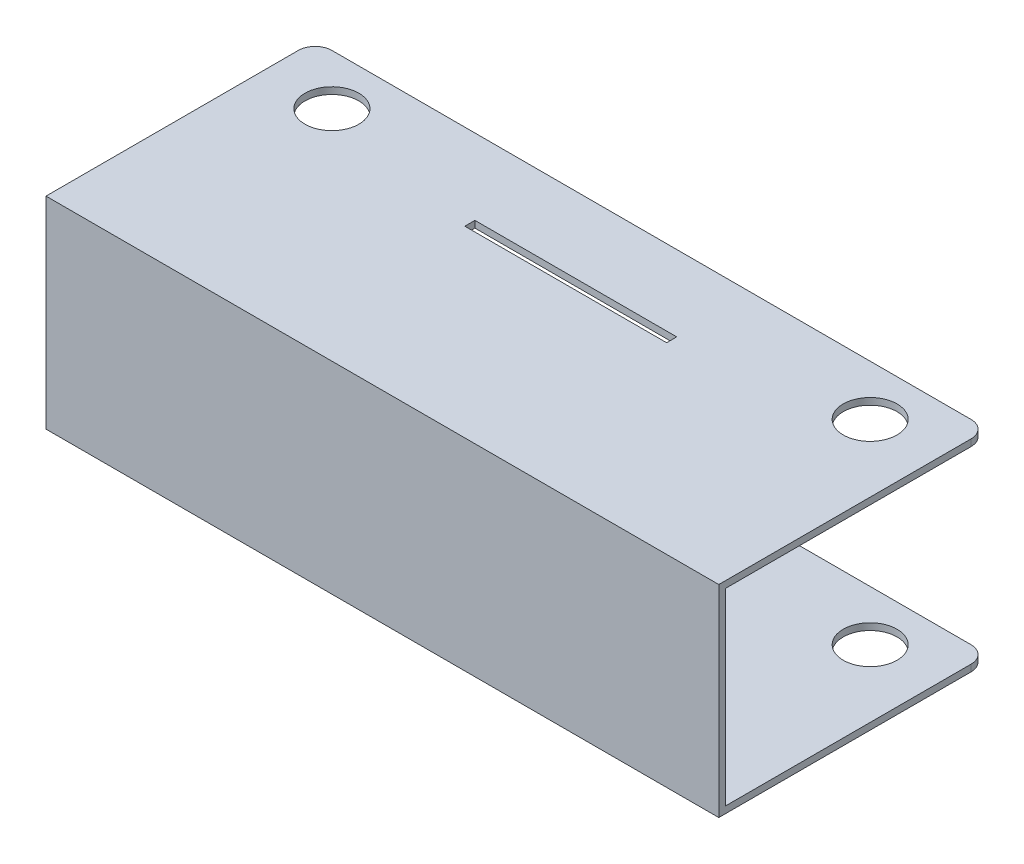
ISO-10303-21;
HEADER;
FILE_DESCRIPTION(('STEP AP214'),'2;1');
FILE_NAME('part.step','',(''),(''),'','','');
FILE_SCHEMA(('AUTOMOTIVE_DESIGN { 1 0 10303 214 1 1 1 1 }'));
ENDSEC;
DATA;
#1=APPLICATION_CONTEXT('core data for automotive mechanical design processes');
#2=APPLICATION_PROTOCOL_DEFINITION('international standard','automotive_design',2000,#1);
#3=PRODUCT_CONTEXT('',#1,'mechanical');
#4=PRODUCT('Part','Part','',(#3));
#5=PRODUCT_RELATED_PRODUCT_CATEGORY('part','',(#4));
#6=PRODUCT_DEFINITION_FORMATION('','',#4);
#7=PRODUCT_DEFINITION_CONTEXT('part definition',#1,'design');
#8=PRODUCT_DEFINITION('design','',#6,#7);
#9=PRODUCT_DEFINITION_SHAPE('','',#8);
#10=(LENGTH_UNIT() NAMED_UNIT(*) SI_UNIT(.MILLI.,.METRE.));
#11=(NAMED_UNIT(*) PLANE_ANGLE_UNIT() SI_UNIT($,.RADIAN.));
#12=(NAMED_UNIT(*) SI_UNIT($,.STERADIAN.) SOLID_ANGLE_UNIT());
#13=UNCERTAINTY_MEASURE_WITH_UNIT(LENGTH_MEASURE(1.E-05),#10,'distance_accuracy_value','');
#14=(GEOMETRIC_REPRESENTATION_CONTEXT(3) GLOBAL_UNCERTAINTY_ASSIGNED_CONTEXT((#13)) GLOBAL_UNIT_ASSIGNED_CONTEXT((#10,
#11,#12)) REPRESENTATION_CONTEXT('',''));
#15=CARTESIAN_POINT('',(0.,0.,0.));
#16=DIRECTION('',(0.,0.,1.));
#17=DIRECTION('',(1.,0.,0.));
#18=AXIS2_PLACEMENT_3D('',#15,#16,#17);
#19=CARTESIAN_POINT('',(0.,0.,0.));
#20=DIRECTION('',(0.,0.,-1.));
#21=DIRECTION('',(-1.,0.,0.));
#22=AXIS2_PLACEMENT_3D('',#19,#20,#21);
#23=PLANE('',#22);
#24=DIRECTION('',(1.,0.,0.));
#25=VECTOR('',#24,1.);
#26=CARTESIAN_POINT('',(-20.,-6.,0.));
#27=LINE('',#26,#25);
#28=CARTESIAN_POINT('',(-19.,-6.,0.));
#29=VERTEX_POINT('',#28);
#30=CARTESIAN_POINT('',(19.,-6.,0.));
#31=VERTEX_POINT('',#30);
#32=EDGE_CURVE('E306',#29,#31,#27,.T.);
#33=ORIENTED_EDGE('',*,*,#32,.F.);
#34=DIRECTION('',(0.,-1.,0.));
#35=VECTOR('',#34,1.);
#36=CARTESIAN_POINT('',(-19.,-5.6,0.));
#37=LINE('',#36,#35);
#38=CARTESIAN_POINT('',(-19.,-5.6,0.));
#39=VERTEX_POINT('',#38);
#40=EDGE_CURVE('E342',#29,#39,#37,.F.);
#41=ORIENTED_EDGE('',*,*,#40,.T.);
#42=DIRECTION('',(1.,0.,0.));
#43=VECTOR('',#42,1.);
#44=CARTESIAN_POINT('',(-20.,-5.6,0.));
#45=LINE('',#44,#43);
#46=CARTESIAN_POINT('',(19.,-5.6,0.));
#47=VERTEX_POINT('',#46);
#48=EDGE_CURVE('E213',#39,#47,#45,.T.);
#49=ORIENTED_EDGE('',*,*,#48,.T.);
#50=DIRECTION('',(0.,1.,0.));
#51=VECTOR('',#50,1.);
#52=CARTESIAN_POINT('',(19.,-6.,0.));
#53=LINE('',#52,#51);
#54=EDGE_CURVE('E340',#47,#31,#53,.F.);
#55=ORIENTED_EDGE('',*,*,#54,.T.);
#56=EDGE_LOOP('',(#33,#41,#49,#55));
#57=FACE_BOUND('',#56,.T.);
#58=ADVANCED_FACE('F38',(#57),#23,.T.);
#59=CARTESIAN_POINT('',(-16.,6.,3.));
#60=DIRECTION('',(0.,-1.,0.));
#61=DIRECTION('',(0.,0.,-1.));
#62=AXIS2_PLACEMENT_3D('',#59,#60,#61);
#63=CYLINDRICAL_SURFACE('',#62,1.6);
#64=CARTESIAN_POINT('',(-16.,-5.6,3.));
#65=DIRECTION('',(0.,-1.,0.));
#66=DIRECTION('',(0.,0.,-1.));
#67=AXIS2_PLACEMENT_3D('',#64,#65,#66);
#68=CIRCLE('',#67,1.6);
#69=CARTESIAN_POINT('',(-16.,-5.6,1.4));
#70=VERTEX_POINT('',#69);
#71=EDGE_CURVE('E246',#70,#70,#68,.F.);
#72=ORIENTED_EDGE('',*,*,#71,.T.);
#73=EDGE_LOOP('',(#72));
#74=FACE_BOUND('',#73,.T.);
#75=CARTESIAN_POINT('',(-16.,-6.,3.));
#76=DIRECTION('',(0.,-1.,0.));
#77=DIRECTION('',(0.,0.,-1.));
#78=AXIS2_PLACEMENT_3D('',#75,#76,#77);
#79=CIRCLE('',#78,1.6);
#80=CARTESIAN_POINT('',(-16.,-6.,1.4));
#81=VERTEX_POINT('',#80);
#82=EDGE_CURVE('E293',#81,#81,#79,.T.);
#83=ORIENTED_EDGE('',*,*,#82,.T.);
#84=EDGE_LOOP('',(#83));
#85=FACE_BOUND('',#84,.T.);
#86=ADVANCED_FACE('F405',(#74,#85),#63,.F.);
#87=CARTESIAN_POINT('',(16.,6.,3.));
#88=DIRECTION('',(0.,-1.,0.));
#89=DIRECTION('',(0.,0.,-1.));
#90=AXIS2_PLACEMENT_3D('',#87,#88,#89);
#91=CYLINDRICAL_SURFACE('',#90,1.6);
#92=CARTESIAN_POINT('',(16.,-5.6,3.));
#93=DIRECTION('',(0.,-1.,0.));
#94=DIRECTION('',(0.,0.,-1.));
#95=AXIS2_PLACEMENT_3D('',#92,#93,#94);
#96=CIRCLE('',#95,1.6);
#97=CARTESIAN_POINT('',(16.,-5.6,1.4));
#98=VERTEX_POINT('',#97);
#99=EDGE_CURVE('E243',#98,#98,#96,.F.);
#100=ORIENTED_EDGE('',*,*,#99,.T.);
#101=EDGE_LOOP('',(#100));
#102=FACE_BOUND('',#101,.T.);
#103=CARTESIAN_POINT('',(16.,-6.,3.));
#104=DIRECTION('',(0.,-1.,0.));
#105=DIRECTION('',(0.,0.,-1.));
#106=AXIS2_PLACEMENT_3D('',#103,#104,#105);
#107=CIRCLE('',#106,1.6);
#108=CARTESIAN_POINT('',(16.,-6.,1.4));
#109=VERTEX_POINT('',#108);
#110=EDGE_CURVE('E277',#109,#109,#107,.T.);
#111=ORIENTED_EDGE('',*,*,#110,.T.);
#112=EDGE_LOOP('',(#111));
#113=FACE_BOUND('',#112,.T.);
#114=ADVANCED_FACE('F410',(#102,#113),#91,.F.);
#115=CARTESIAN_POINT('',(6.,6.,5.1));
#116=DIRECTION('',(1.,0.,0.));
#117=DIRECTION('',(0.,0.,-1.));
#118=AXIS2_PLACEMENT_3D('',#115,#116,#117);
#119=PLANE('',#118);
#120=DIRECTION('',(0.,-1.,0.));
#121=VECTOR('',#120,1.);
#122=CARTESIAN_POINT('',(6.,6.,5.1));
#123=LINE('',#122,#121);
#124=CARTESIAN_POINT('',(6.,-5.6,5.1));
#125=VERTEX_POINT('',#124);
#126=CARTESIAN_POINT('',(6.,-6.,5.1));
#127=VERTEX_POINT('',#126);
#128=EDGE_CURVE('E263',#125,#127,#123,.T.);
#129=ORIENTED_EDGE('',*,*,#128,.F.);
#130=DIRECTION('',(0.,0.,-1.));
#131=VECTOR('',#130,1.);
#132=CARTESIAN_POINT('',(6.,-5.6,5.1));
#133=LINE('',#132,#131);
#134=CARTESIAN_POINT('',(6.,-5.6,4.5));
#135=VERTEX_POINT('',#134);
#136=EDGE_CURVE('E240',#125,#135,#133,.T.);
#137=ORIENTED_EDGE('',*,*,#136,.T.);
#138=DIRECTION('',(0.,-1.,0.));
#139=VECTOR('',#138,1.);
#140=CARTESIAN_POINT('',(6.,6.,4.5));
#141=LINE('',#140,#139);
#142=CARTESIAN_POINT('',(6.,-6.,4.5));
#143=VERTEX_POINT('',#142);
#144=EDGE_CURVE('E278',#135,#143,#141,.T.);
#145=ORIENTED_EDGE('',*,*,#144,.T.);
#146=DIRECTION('',(0.,0.,1.));
#147=VECTOR('',#146,1.);
#148=CARTESIAN_POINT('',(6.,-6.,5.1));
#149=LINE('',#148,#147);
#150=EDGE_CURVE('E249',#143,#127,#149,.T.);
#151=ORIENTED_EDGE('',*,*,#150,.T.);
#152=EDGE_LOOP('',(#129,#137,#145,#151));
#153=FACE_BOUND('',#152,.T.);
#154=ADVANCED_FACE('F436',(#153),#119,.F.);
#155=CARTESIAN_POINT('',(-6.,6.,4.5));
#156=DIRECTION('',(0.,0.,-1.));
#157=DIRECTION('',(-1.,0.,0.));
#158=AXIS2_PLACEMENT_3D('',#155,#156,#157);
#159=PLANE('',#158);
#160=ORIENTED_EDGE('',*,*,#144,.F.);
#161=DIRECTION('',(-1.,0.,0.));
#162=VECTOR('',#161,1.);
#163=CARTESIAN_POINT('',(-6.,-5.6,4.5));
#164=LINE('',#163,#162);
#165=CARTESIAN_POINT('',(-6.,-5.6,4.5));
#166=VERTEX_POINT('',#165);
#167=EDGE_CURVE('E237',#135,#166,#164,.T.);
#168=ORIENTED_EDGE('',*,*,#167,.T.);
#169=DIRECTION('',(0.,-1.,0.));
#170=VECTOR('',#169,1.);
#171=CARTESIAN_POINT('',(-6.,6.,4.5));
#172=LINE('',#171,#170);
#173=CARTESIAN_POINT('',(-6.,-6.,4.5));
#174=VERTEX_POINT('',#173);
#175=EDGE_CURVE('E282',#166,#174,#172,.T.);
#176=ORIENTED_EDGE('',*,*,#175,.T.);
#177=DIRECTION('',(1.,0.,0.));
#178=VECTOR('',#177,1.);
#179=CARTESIAN_POINT('',(-6.,-6.,4.5));
#180=LINE('',#179,#178);
#181=EDGE_CURVE('E254',#174,#143,#180,.T.);
#182=ORIENTED_EDGE('',*,*,#181,.T.);
#183=EDGE_LOOP('',(#160,#168,#176,#182));
#184=FACE_BOUND('',#183,.T.);
#185=ADVANCED_FACE('F450',(#184),#159,.F.);
#186=CARTESIAN_POINT('',(-6.,6.,5.1));
#187=DIRECTION('',(-1.,0.,0.));
#188=DIRECTION('',(0.,0.,1.));
#189=AXIS2_PLACEMENT_3D('',#186,#187,#188);
#190=PLANE('',#189);
#191=ORIENTED_EDGE('',*,*,#175,.F.);
#192=DIRECTION('',(0.,0.,1.));
#193=VECTOR('',#192,1.);
#194=CARTESIAN_POINT('',(-6.,-5.6,5.1));
#195=LINE('',#194,#193);
#196=CARTESIAN_POINT('',(-6.,-5.6,5.1));
#197=VERTEX_POINT('',#196);
#198=EDGE_CURVE('E234',#166,#197,#195,.T.);
#199=ORIENTED_EDGE('',*,*,#198,.T.);
#200=DIRECTION('',(0.,-1.,0.));
#201=VECTOR('',#200,1.);
#202=CARTESIAN_POINT('',(-6.,6.,5.1));
#203=LINE('',#202,#201);
#204=CARTESIAN_POINT('',(-6.,-6.,5.1));
#205=VERTEX_POINT('',#204);
#206=EDGE_CURVE('E286',#197,#205,#203,.T.);
#207=ORIENTED_EDGE('',*,*,#206,.T.);
#208=DIRECTION('',(0.,0.,-1.));
#209=VECTOR('',#208,1.);
#210=CARTESIAN_POINT('',(-6.,-6.,5.1));
#211=LINE('',#210,#209);
#212=EDGE_CURVE('E269',#205,#174,#211,.T.);
#213=ORIENTED_EDGE('',*,*,#212,.T.);
#214=EDGE_LOOP('',(#191,#199,#207,#213));
#215=FACE_BOUND('',#214,.T.);
#216=ADVANCED_FACE('F446',(#215),#190,.F.);
#217=CARTESIAN_POINT('',(-6.,6.,5.1));
#218=DIRECTION('',(0.,0.,1.));
#219=DIRECTION('',(1.,0.,0.));
#220=AXIS2_PLACEMENT_3D('',#217,#218,#219);
#221=PLANE('',#220);
#222=ORIENTED_EDGE('',*,*,#206,.F.);
#223=DIRECTION('',(1.,0.,0.));
#224=VECTOR('',#223,1.);
#225=CARTESIAN_POINT('',(-6.,-5.6,5.1));
#226=LINE('',#225,#224);
#227=EDGE_CURVE('E329',#197,#125,#226,.T.);
#228=ORIENTED_EDGE('',*,*,#227,.T.);
#229=ORIENTED_EDGE('',*,*,#128,.T.);
#230=DIRECTION('',(-1.,0.,0.));
#231=VECTOR('',#230,1.);
#232=CARTESIAN_POINT('',(-6.,-6.,5.1));
#233=LINE('',#232,#231);
#234=EDGE_CURVE('E266',#127,#205,#233,.T.);
#235=ORIENTED_EDGE('',*,*,#234,.T.);
#236=EDGE_LOOP('',(#222,#228,#229,#235));
#237=FACE_BOUND('',#236,.T.);
#238=ADVANCED_FACE('F442',(#237),#221,.F.);
#239=CARTESIAN_POINT('',(20.,-6.,16.));
#240=DIRECTION('',(-1.,0.,0.));
#241=DIRECTION('',(0.,0.,1.));
#242=AXIS2_PLACEMENT_3D('',#239,#240,#241);
#243=PLANE('',#242);
#244=DIRECTION('',(0.,0.,1.));
#245=VECTOR('',#244,1.);
#246=CARTESIAN_POINT('',(20.,5.6,0.));
#247=LINE('',#246,#245);
#248=CARTESIAN_POINT('',(20.,5.6,1.));
#249=VERTEX_POINT('',#248);
#250=CARTESIAN_POINT('',(20.,5.6,15.6));
#251=VERTEX_POINT('',#250);
#252=EDGE_CURVE('E195',#249,#251,#247,.T.);
#253=ORIENTED_EDGE('',*,*,#252,.F.);
#254=DIRECTION('',(0.,1.,0.));
#255=VECTOR('',#254,1.);
#256=CARTESIAN_POINT('',(20.,6.,1.));
#257=LINE('',#256,#255);
#258=CARTESIAN_POINT('',(20.,6.,1.));
#259=VERTEX_POINT('',#258);
#260=EDGE_CURVE('E11',#249,#259,#257,.T.);
#261=ORIENTED_EDGE('',*,*,#260,.T.);
#262=DIRECTION('',(0.,0.,-1.));
#263=VECTOR('',#262,1.);
#264=CARTESIAN_POINT('',(20.,6.,16.));
#265=LINE('',#264,#263);
#266=CARTESIAN_POINT('',(20.,6.,16.));
#267=VERTEX_POINT('',#266);
#268=EDGE_CURVE('E323',#267,#259,#265,.T.);
#269=ORIENTED_EDGE('',*,*,#268,.F.);
#270=DIRECTION('',(0.,1.,0.));
#271=VECTOR('',#270,1.);
#272=CARTESIAN_POINT('',(20.,-6.,16.));
#273=LINE('',#272,#271);
#274=CARTESIAN_POINT('',(20.,-6.,16.));
#275=VERTEX_POINT('',#274);
#276=EDGE_CURVE('E302',#275,#267,#273,.T.);
#277=ORIENTED_EDGE('',*,*,#276,.F.);
#278=DIRECTION('',(0.,0.,-1.));
#279=VECTOR('',#278,1.);
#280=CARTESIAN_POINT('',(20.,-6.,16.));
#281=LINE('',#280,#279);
#282=CARTESIAN_POINT('',(20.,-6.,1.));
#283=VERTEX_POINT('',#282);
#284=EDGE_CURVE('E312',#275,#283,#281,.T.);
#285=ORIENTED_EDGE('',*,*,#284,.T.);
#286=DIRECTION('',(0.,1.,0.));
#287=VECTOR('',#286,1.);
#288=CARTESIAN_POINT('',(20.,-5.6,1.));
#289=LINE('',#288,#287);
#290=CARTESIAN_POINT('',(20.,-5.6,1.));
#291=VERTEX_POINT('',#290);
#292=EDGE_CURVE('E46',#283,#291,#289,.T.);
#293=ORIENTED_EDGE('',*,*,#292,.T.);
#294=DIRECTION('',(0.,0.,-1.));
#295=VECTOR('',#294,1.);
#296=CARTESIAN_POINT('',(20.,-5.6,0.));
#297=LINE('',#296,#295);
#298=CARTESIAN_POINT('',(20.,-5.6,15.6));
#299=VERTEX_POINT('',#298);
#300=EDGE_CURVE('E188',#299,#291,#297,.T.);
#301=ORIENTED_EDGE('',*,*,#300,.F.);
#302=DIRECTION('',(0.,-1.,0.));
#303=VECTOR('',#302,1.);
#304=CARTESIAN_POINT('',(20.,5.6,15.6));
#305=LINE('',#304,#303);
#306=EDGE_CURVE('E209',#251,#299,#305,.T.);
#307=ORIENTED_EDGE('',*,*,#306,.F.);
#308=EDGE_LOOP('',(#253,#261,#269,#277,#285,#293,#301,#307));
#309=FACE_BOUND('',#308,.T.);
#310=ADVANCED_FACE('F361',(#309),#243,.F.);
#311=CARTESIAN_POINT('',(-20.,6.,16.));
#312=DIRECTION('',(0.,-1.,0.));
#313=DIRECTION('',(0.,0.,-1.));
#314=AXIS2_PLACEMENT_3D('',#311,#312,#313);
#315=PLANE('',#314);
#316=DIRECTION('',(1.,0.,0.));
#317=VECTOR('',#316,1.);
#318=CARTESIAN_POINT('',(-6.,6.,4.5));
#319=LINE('',#318,#317);
#320=CARTESIAN_POINT('',(-6.,6.,4.5));
#321=VERTEX_POINT('',#320);
#322=CARTESIAN_POINT('',(6.,6.,4.5));
#323=VERTEX_POINT('',#322);
#324=EDGE_CURVE('E260',#321,#323,#319,.T.);
#325=ORIENTED_EDGE('',*,*,#324,.T.);
#326=DIRECTION('',(0.,0.,1.));
#327=VECTOR('',#326,1.);
#328=CARTESIAN_POINT('',(6.,6.,5.1));
#329=LINE('',#328,#327);
#330=CARTESIAN_POINT('',(6.,6.,5.1));
#331=VERTEX_POINT('',#330);
#332=EDGE_CURVE('E250',#323,#331,#329,.T.);
#333=ORIENTED_EDGE('',*,*,#332,.T.);
#334=DIRECTION('',(-1.,0.,0.));
#335=VECTOR('',#334,1.);
#336=CARTESIAN_POINT('',(-6.,6.,5.1));
#337=LINE('',#336,#335);
#338=CARTESIAN_POINT('',(-6.,6.,5.1));
#339=VERTEX_POINT('',#338);
#340=EDGE_CURVE('E253',#331,#339,#337,.T.);
#341=ORIENTED_EDGE('',*,*,#340,.T.);
#342=DIRECTION('',(0.,0.,-1.));
#343=VECTOR('',#342,1.);
#344=CARTESIAN_POINT('',(-6.,6.,5.1));
#345=LINE('',#344,#343);
#346=EDGE_CURVE('E257',#339,#321,#345,.T.);
#347=ORIENTED_EDGE('',*,*,#346,.T.);
#348=EDGE_LOOP('',(#325,#333,#341,#347));
#349=FACE_BOUND('',#348,.T.);
#350=CARTESIAN_POINT('',(16.,6.,3.));
#351=DIRECTION('',(0.,-1.,0.));
#352=DIRECTION('',(0.,0.,-1.));
#353=AXIS2_PLACEMENT_3D('',#350,#351,#352);
#354=CIRCLE('',#353,1.6);
#355=CARTESIAN_POINT('',(16.,6.,1.4));
#356=VERTEX_POINT('',#355);
#357=EDGE_CURVE('E290',#356,#356,#354,.T.);
#358=ORIENTED_EDGE('',*,*,#357,.T.);
#359=EDGE_LOOP('',(#358));
#360=FACE_BOUND('',#359,.T.);
#361=CARTESIAN_POINT('',(-16.,6.,3.));
#362=DIRECTION('',(0.,-1.,0.));
#363=DIRECTION('',(0.,0.,-1.));
#364=AXIS2_PLACEMENT_3D('',#361,#362,#363);
#365=CIRCLE('',#364,1.6);
#366=CARTESIAN_POINT('',(-16.,6.,1.4));
#367=VERTEX_POINT('',#366);
#368=EDGE_CURVE('E296',#367,#367,#365,.T.);
#369=ORIENTED_EDGE('',*,*,#368,.T.);
#370=EDGE_LOOP('',(#369));
#371=FACE_BOUND('',#370,.T.);
#372=DIRECTION('',(-1.,0.,0.));
#373=VECTOR('',#372,1.);
#374=CARTESIAN_POINT('',(-20.,6.,0.));
#375=LINE('',#374,#373);
#376=CARTESIAN_POINT('',(19.,6.,0.));
#377=VERTEX_POINT('',#376);
#378=CARTESIAN_POINT('',(-19.,6.,0.));
#379=VERTEX_POINT('',#378);
#380=EDGE_CURVE('E299',#377,#379,#375,.T.);
#381=ORIENTED_EDGE('',*,*,#380,.T.);
#382=CARTESIAN_POINT('',(-19.,6.,1.));
#383=DIRECTION('',(0.,-1.,0.));
#384=DIRECTION('',(0.,0.,-1.));
#385=AXIS2_PLACEMENT_3D('',#382,#383,#384);
#386=CIRCLE('',#385,1.);
#387=CARTESIAN_POINT('',(-20.,6.,1.));
#388=VERTEX_POINT('',#387);
#389=EDGE_CURVE('E356',#379,#388,#386,.F.);
#390=ORIENTED_EDGE('',*,*,#389,.T.);
#391=DIRECTION('',(0.,0.,-1.));
#392=VECTOR('',#391,1.);
#393=CARTESIAN_POINT('',(-20.,6.,16.));
#394=LINE('',#393,#392);
#395=CARTESIAN_POINT('',(-20.,6.,16.));
#396=VERTEX_POINT('',#395);
#397=EDGE_CURVE('E321',#396,#388,#394,.T.);
#398=ORIENTED_EDGE('',*,*,#397,.F.);
#399=DIRECTION('',(-1.,0.,0.));
#400=VECTOR('',#399,1.);
#401=CARTESIAN_POINT('',(-20.,6.,16.));
#402=LINE('',#401,#400);
#403=EDGE_CURVE('E305',#267,#396,#402,.T.);
#404=ORIENTED_EDGE('',*,*,#403,.F.);
#405=ORIENTED_EDGE('',*,*,#268,.T.);
#406=CARTESIAN_POINT('',(19.,6.,1.));
#407=DIRECTION('',(0.,-1.,0.));
#408=DIRECTION('',(0.,0.,-1.));
#409=AXIS2_PLACEMENT_3D('',#406,#407,#408);
#410=CIRCLE('',#409,1.);
#411=EDGE_CURVE('E53',#259,#377,#410,.F.);
#412=ORIENTED_EDGE('',*,*,#411,.T.);
#413=EDGE_LOOP('',(#381,#390,#398,#404,#405,#412));
#414=FACE_BOUND('',#413,.T.);
#415=ADVANCED_FACE('F379',(#349,#360,#371,#414),#315,.F.);
#416=CARTESIAN_POINT('',(-20.,-6.,16.));
#417=DIRECTION('',(1.,0.,0.));
#418=DIRECTION('',(0.,0.,-1.));
#419=AXIS2_PLACEMENT_3D('',#416,#417,#418);
#420=PLANE('',#419);
#421=DIRECTION('',(0.,0.,-1.));
#422=VECTOR('',#421,1.);
#423=CARTESIAN_POINT('',(-20.,-5.6,0.));
#424=LINE('',#423,#422);
#425=CARTESIAN_POINT('',(-20.,-5.6,15.6));
#426=VERTEX_POINT('',#425);
#427=CARTESIAN_POINT('',(-20.,-5.6,1.));
#428=VERTEX_POINT('',#427);
#429=EDGE_CURVE('E204',#426,#428,#424,.T.);
#430=ORIENTED_EDGE('',*,*,#429,.T.);
#431=DIRECTION('',(0.,-1.,0.));
#432=VECTOR('',#431,1.);
#433=CARTESIAN_POINT('',(-20.,-6.,1.));
#434=LINE('',#433,#432);
#435=CARTESIAN_POINT('',(-20.,-6.,1.));
#436=VERTEX_POINT('',#435);
#437=EDGE_CURVE('E333',#428,#436,#434,.T.);
#438=ORIENTED_EDGE('',*,*,#437,.T.);
#439=DIRECTION('',(0.,0.,-1.));
#440=VECTOR('',#439,1.);
#441=CARTESIAN_POINT('',(-20.,-6.,16.));
#442=LINE('',#441,#440);
#443=CARTESIAN_POINT('',(-20.,-6.,16.));
#444=VERTEX_POINT('',#443);
#445=EDGE_CURVE('E318',#444,#436,#442,.T.);
#446=ORIENTED_EDGE('',*,*,#445,.F.);
#447=DIRECTION('',(0.,-1.,0.));
#448=VECTOR('',#447,1.);
#449=CARTESIAN_POINT('',(-20.,-6.,16.));
#450=LINE('',#449,#448);
#451=EDGE_CURVE('E308',#396,#444,#450,.T.);
#452=ORIENTED_EDGE('',*,*,#451,.F.);
#453=ORIENTED_EDGE('',*,*,#397,.T.);
#454=DIRECTION('',(0.,-1.,0.));
#455=VECTOR('',#454,1.);
#456=CARTESIAN_POINT('',(-20.,5.6,1.));
#457=LINE('',#456,#455);
#458=CARTESIAN_POINT('',(-20.,5.6,1.));
#459=VERTEX_POINT('',#458);
#460=EDGE_CURVE('E186',#388,#459,#457,.T.);
#461=ORIENTED_EDGE('',*,*,#460,.T.);
#462=DIRECTION('',(0.,0.,1.));
#463=VECTOR('',#462,1.);
#464=CARTESIAN_POINT('',(-20.,5.6,0.));
#465=LINE('',#464,#463);
#466=CARTESIAN_POINT('',(-20.,5.6,15.6));
#467=VERTEX_POINT('',#466);
#468=EDGE_CURVE('E178',#459,#467,#465,.T.);
#469=ORIENTED_EDGE('',*,*,#468,.T.);
#470=DIRECTION('',(0.,-1.,0.));
#471=VECTOR('',#470,1.);
#472=CARTESIAN_POINT('',(-20.,5.6,15.6));
#473=LINE('',#472,#471);
#474=EDGE_CURVE('E183',#467,#426,#473,.T.);
#475=ORIENTED_EDGE('',*,*,#474,.T.);
#476=EDGE_LOOP('',(#430,#438,#446,#452,#453,#461,#469,#475));
#477=FACE_BOUND('',#476,.T.);
#478=ADVANCED_FACE('F181',(#477),#420,.F.);
#479=CARTESIAN_POINT('',(-20.,-6.,16.));
#480=DIRECTION('',(0.,1.,0.));
#481=DIRECTION('',(0.,0.,1.));
#482=AXIS2_PLACEMENT_3D('',#479,#480,#481);
#483=PLANE('',#482);
#484=ORIENTED_EDGE('',*,*,#234,.F.);
#485=ORIENTED_EDGE('',*,*,#150,.F.);
#486=ORIENTED_EDGE('',*,*,#181,.F.);
#487=ORIENTED_EDGE('',*,*,#212,.F.);
#488=EDGE_LOOP('',(#484,#485,#486,#487));
#489=FACE_BOUND('',#488,.T.);
#490=ORIENTED_EDGE('',*,*,#110,.F.);
#491=EDGE_LOOP('',(#490));
#492=FACE_BOUND('',#491,.T.);
#493=ORIENTED_EDGE('',*,*,#82,.F.);
#494=EDGE_LOOP('',(#493));
#495=FACE_BOUND('',#494,.T.);
#496=ORIENTED_EDGE('',*,*,#445,.T.);
#497=CARTESIAN_POINT('',(-19.,-6.,1.));
#498=DIRECTION('',(0.,1.,0.));
#499=DIRECTION('',(0.,0.,1.));
#500=AXIS2_PLACEMENT_3D('',#497,#498,#499);
#501=CIRCLE('',#500,1.);
#502=EDGE_CURVE('E338',#436,#29,#501,.F.);
#503=ORIENTED_EDGE('',*,*,#502,.T.);
#504=ORIENTED_EDGE('',*,*,#32,.T.);
#505=CARTESIAN_POINT('',(19.,-6.,1.));
#506=DIRECTION('',(0.,1.,0.));
#507=DIRECTION('',(0.,0.,1.));
#508=AXIS2_PLACEMENT_3D('',#505,#506,#507);
#509=CIRCLE('',#508,1.);
#510=EDGE_CURVE('E336',#31,#283,#509,.F.);
#511=ORIENTED_EDGE('',*,*,#510,.T.);
#512=ORIENTED_EDGE('',*,*,#284,.F.);
#513=DIRECTION('',(1.,0.,0.));
#514=VECTOR('',#513,1.);
#515=CARTESIAN_POINT('',(-20.,-6.,16.));
#516=LINE('',#515,#514);
#517=EDGE_CURVE('E310',#444,#275,#516,.T.);
#518=ORIENTED_EDGE('',*,*,#517,.F.);
#519=EDGE_LOOP('',(#496,#503,#504,#511,#512,#518));
#520=FACE_BOUND('',#519,.T.);
#521=ADVANCED_FACE('F386',(#489,#492,#495,#520),#483,.F.);
#522=CARTESIAN_POINT('',(0.,0.,16.));
#523=DIRECTION('',(0.,0.,-1.));
#524=DIRECTION('',(-1.,0.,0.));
#525=AXIS2_PLACEMENT_3D('',#522,#523,#524);
#526=PLANE('',#525);
#527=ORIENTED_EDGE('',*,*,#276,.T.);
#528=ORIENTED_EDGE('',*,*,#403,.T.);
#529=ORIENTED_EDGE('',*,*,#451,.T.);
#530=ORIENTED_EDGE('',*,*,#517,.T.);
#531=EDGE_LOOP('',(#527,#528,#529,#530));
#532=FACE_BOUND('',#531,.T.);
#533=ADVANCED_FACE('F384',(#532),#526,.F.);
#534=DIRECTION('',(1.,0.,0.));
#535=VECTOR('',#534,1.);
#536=CARTESIAN_POINT('',(-20.,5.6,0.));
#537=LINE('',#536,#535);
#538=CARTESIAN_POINT('',(-19.,5.6,0.));
#539=VERTEX_POINT('',#538);
#540=CARTESIAN_POINT('',(19.,5.6,0.));
#541=VERTEX_POINT('',#540);
#542=EDGE_CURVE('E200',#539,#541,#537,.T.);
#543=ORIENTED_EDGE('',*,*,#542,.F.);
#544=DIRECTION('',(0.,-1.,0.));
#545=VECTOR('',#544,1.);
#546=CARTESIAN_POINT('',(-19.,6.,0.));
#547=LINE('',#546,#545);
#548=EDGE_CURVE('E60',#539,#379,#547,.F.);
#549=ORIENTED_EDGE('',*,*,#548,.T.);
#550=ORIENTED_EDGE('',*,*,#380,.F.);
#551=DIRECTION('',(0.,1.,0.));
#552=VECTOR('',#551,1.);
#553=CARTESIAN_POINT('',(19.,5.6,0.));
#554=LINE('',#553,#552);
#555=EDGE_CURVE('E352',#377,#541,#554,.F.);
#556=ORIENTED_EDGE('',*,*,#555,.T.);
#557=EDGE_LOOP('',(#543,#549,#550,#556));
#558=FACE_BOUND('',#557,.T.);
#559=ADVANCED_FACE('F373',(#558),#23,.T.);
#560=CARTESIAN_POINT('',(-16.,5.6,3.));
#561=DIRECTION('',(0.,1.,0.));
#562=DIRECTION('',(0.,0.,1.));
#563=AXIS2_PLACEMENT_3D('',#560,#561,#562);
#564=CIRCLE('',#563,1.6);
#565=CARTESIAN_POINT('',(-16.,5.6,4.6));
#566=VERTEX_POINT('',#565);
#567=EDGE_CURVE('E231',#566,#566,#564,.F.);
#568=ORIENTED_EDGE('',*,*,#567,.T.);
#569=EDGE_LOOP('',(#568));
#570=FACE_BOUND('',#569,.T.);
#571=ORIENTED_EDGE('',*,*,#368,.F.);
#572=EDGE_LOOP('',(#571));
#573=FACE_BOUND('',#572,.T.);
#574=ADVANCED_FACE('F413',(#570,#573),#63,.F.);
#575=CARTESIAN_POINT('',(16.,5.6,3.));
#576=DIRECTION('',(0.,1.,0.));
#577=DIRECTION('',(0.,0.,1.));
#578=AXIS2_PLACEMENT_3D('',#575,#576,#577);
#579=CIRCLE('',#578,1.6);
#580=CARTESIAN_POINT('',(16.,5.6,4.6));
#581=VERTEX_POINT('',#580);
#582=EDGE_CURVE('E228',#581,#581,#579,.F.);
#583=ORIENTED_EDGE('',*,*,#582,.T.);
#584=EDGE_LOOP('',(#583));
#585=FACE_BOUND('',#584,.T.);
#586=ORIENTED_EDGE('',*,*,#357,.F.);
#587=EDGE_LOOP('',(#586));
#588=FACE_BOUND('',#587,.T.);
#589=ADVANCED_FACE('F421',(#585,#588),#91,.F.);
#590=CARTESIAN_POINT('',(6.,5.6,4.5));
#591=VERTEX_POINT('',#590);
#592=EDGE_CURVE('E274',#323,#591,#141,.T.);
#593=ORIENTED_EDGE('',*,*,#592,.T.);
#594=DIRECTION('',(0.,0.,1.));
#595=VECTOR('',#594,1.);
#596=CARTESIAN_POINT('',(6.,5.6,5.1));
#597=LINE('',#596,#595);
#598=CARTESIAN_POINT('',(6.,5.6,5.1));
#599=VERTEX_POINT('',#598);
#600=EDGE_CURVE('E225',#591,#599,#597,.T.);
#601=ORIENTED_EDGE('',*,*,#600,.T.);
#602=EDGE_CURVE('E287',#331,#599,#123,.T.);
#603=ORIENTED_EDGE('',*,*,#602,.F.);
#604=ORIENTED_EDGE('',*,*,#332,.F.);
#605=EDGE_LOOP('',(#593,#601,#603,#604));
#606=FACE_BOUND('',#605,.T.);
#607=ADVANCED_FACE('F430',(#606),#119,.F.);
#608=CARTESIAN_POINT('',(-6.,5.6,4.5));
#609=VERTEX_POINT('',#608);
#610=EDGE_CURVE('E279',#321,#609,#172,.T.);
#611=ORIENTED_EDGE('',*,*,#610,.T.);
#612=DIRECTION('',(1.,0.,0.));
#613=VECTOR('',#612,1.);
#614=CARTESIAN_POINT('',(-6.,5.6,4.5));
#615=LINE('',#614,#613);
#616=EDGE_CURVE('E222',#609,#591,#615,.T.);
#617=ORIENTED_EDGE('',*,*,#616,.T.);
#618=ORIENTED_EDGE('',*,*,#592,.F.);
#619=ORIENTED_EDGE('',*,*,#324,.F.);
#620=EDGE_LOOP('',(#611,#617,#618,#619));
#621=FACE_BOUND('',#620,.T.);
#622=ADVANCED_FACE('F434',(#621),#159,.F.);
#623=CARTESIAN_POINT('',(-6.,5.6,5.1));
#624=VERTEX_POINT('',#623);
#625=EDGE_CURVE('E283',#339,#624,#203,.T.);
#626=ORIENTED_EDGE('',*,*,#625,.T.);
#627=DIRECTION('',(0.,0.,-1.));
#628=VECTOR('',#627,1.);
#629=CARTESIAN_POINT('',(-6.,5.6,5.1));
#630=LINE('',#629,#628);
#631=EDGE_CURVE('E216',#624,#609,#630,.T.);
#632=ORIENTED_EDGE('',*,*,#631,.T.);
#633=ORIENTED_EDGE('',*,*,#610,.F.);
#634=ORIENTED_EDGE('',*,*,#346,.F.);
#635=EDGE_LOOP('',(#626,#632,#633,#634));
#636=FACE_BOUND('',#635,.T.);
#637=ADVANCED_FACE('F440',(#636),#190,.F.);
#638=ORIENTED_EDGE('',*,*,#602,.T.);
#639=DIRECTION('',(-1.,0.,0.));
#640=VECTOR('',#639,1.);
#641=CARTESIAN_POINT('',(-6.,5.6,5.1));
#642=LINE('',#641,#640);
#643=EDGE_CURVE('E326',#599,#624,#642,.T.);
#644=ORIENTED_EDGE('',*,*,#643,.T.);
#645=ORIENTED_EDGE('',*,*,#625,.F.);
#646=ORIENTED_EDGE('',*,*,#340,.F.);
#647=EDGE_LOOP('',(#638,#644,#645,#646));
#648=FACE_BOUND('',#647,.T.);
#649=ADVANCED_FACE('F437',(#648),#221,.F.);
#650=CARTESIAN_POINT('',(-20.,-5.6,0.));
#651=DIRECTION('',(0.,-1.,0.));
#652=DIRECTION('',(0.,0.,-1.));
#653=AXIS2_PLACEMENT_3D('',#650,#651,#652);
#654=PLANE('',#653);
#655=ORIENTED_EDGE('',*,*,#99,.F.);
#656=EDGE_LOOP('',(#655));
#657=FACE_BOUND('',#656,.T.);
#658=ORIENTED_EDGE('',*,*,#48,.F.);
#659=CARTESIAN_POINT('',(-19.,-5.6,1.));
#660=DIRECTION('',(0.,-1.,0.));
#661=DIRECTION('',(0.,0.,-1.));
#662=AXIS2_PLACEMENT_3D('',#659,#660,#661);
#663=CIRCLE('',#662,1.);
#664=EDGE_CURVE('E346',#39,#428,#663,.F.);
#665=ORIENTED_EDGE('',*,*,#664,.T.);
#666=ORIENTED_EDGE('',*,*,#429,.F.);
#667=DIRECTION('',(1.,0.,0.));
#668=VECTOR('',#667,1.);
#669=CARTESIAN_POINT('',(-20.,-5.6,15.6));
#670=LINE('',#669,#668);
#671=EDGE_CURVE('E199',#426,#299,#670,.T.);
#672=ORIENTED_EDGE('',*,*,#671,.T.);
#673=ORIENTED_EDGE('',*,*,#300,.T.);
#674=CARTESIAN_POINT('',(19.,-5.6,1.));
#675=DIRECTION('',(0.,-1.,0.));
#676=DIRECTION('',(0.,0.,-1.));
#677=AXIS2_PLACEMENT_3D('',#674,#675,#676);
#678=CIRCLE('',#677,1.);
#679=EDGE_CURVE('E344',#291,#47,#678,.F.);
#680=ORIENTED_EDGE('',*,*,#679,.T.);
#681=EDGE_LOOP('',(#658,#665,#666,#672,#673,#680));
#682=FACE_BOUND('',#681,.T.);
#683=ORIENTED_EDGE('',*,*,#227,.F.);
#684=ORIENTED_EDGE('',*,*,#198,.F.);
#685=ORIENTED_EDGE('',*,*,#167,.F.);
#686=ORIENTED_EDGE('',*,*,#136,.F.);
#687=EDGE_LOOP('',(#683,#684,#685,#686));
#688=FACE_BOUND('',#687,.T.);
#689=ORIENTED_EDGE('',*,*,#71,.F.);
#690=EDGE_LOOP('',(#689));
#691=FACE_BOUND('',#690,.T.);
#692=ADVANCED_FACE('F368',(#657,#682,#688,#691),#654,.F.);
#693=CARTESIAN_POINT('',(-20.,5.6,0.));
#694=DIRECTION('',(0.,1.,0.));
#695=DIRECTION('',(0.,0.,1.));
#696=AXIS2_PLACEMENT_3D('',#693,#694,#695);
#697=PLANE('',#696);
#698=ORIENTED_EDGE('',*,*,#582,.F.);
#699=EDGE_LOOP('',(#698));
#700=FACE_BOUND('',#699,.T.);
#701=ORIENTED_EDGE('',*,*,#468,.F.);
#702=CARTESIAN_POINT('',(-19.,5.6,1.));
#703=DIRECTION('',(0.,1.,0.));
#704=DIRECTION('',(0.,0.,1.));
#705=AXIS2_PLACEMENT_3D('',#702,#703,#704);
#706=CIRCLE('',#705,1.);
#707=EDGE_CURVE('E350',#459,#539,#706,.F.);
#708=ORIENTED_EDGE('',*,*,#707,.T.);
#709=ORIENTED_EDGE('',*,*,#542,.T.);
#710=CARTESIAN_POINT('',(19.,5.6,1.));
#711=DIRECTION('',(0.,1.,0.));
#712=DIRECTION('',(0.,0.,1.));
#713=AXIS2_PLACEMENT_3D('',#710,#711,#712);
#714=CIRCLE('',#713,1.);
#715=EDGE_CURVE('E348',#541,#249,#714,.F.);
#716=ORIENTED_EDGE('',*,*,#715,.T.);
#717=ORIENTED_EDGE('',*,*,#252,.T.);
#718=DIRECTION('',(1.,0.,0.));
#719=VECTOR('',#718,1.);
#720=CARTESIAN_POINT('',(-20.,5.6,15.6));
#721=LINE('',#720,#719);
#722=EDGE_CURVE('E191',#467,#251,#721,.T.);
#723=ORIENTED_EDGE('',*,*,#722,.F.);
#724=EDGE_LOOP('',(#701,#708,#709,#716,#717,#723));
#725=FACE_BOUND('',#724,.T.);
#726=ORIENTED_EDGE('',*,*,#616,.F.);
#727=ORIENTED_EDGE('',*,*,#631,.F.);
#728=ORIENTED_EDGE('',*,*,#643,.F.);
#729=ORIENTED_EDGE('',*,*,#600,.F.);
#730=EDGE_LOOP('',(#726,#727,#728,#729));
#731=FACE_BOUND('',#730,.T.);
#732=ORIENTED_EDGE('',*,*,#567,.F.);
#733=EDGE_LOOP('',(#732));
#734=FACE_BOUND('',#733,.T.);
#735=ADVANCED_FACE('F192',(#700,#725,#731,#734),#697,.F.);
#736=CARTESIAN_POINT('',(-20.,5.6,15.6));
#737=DIRECTION('',(0.,0.,1.));
#738=DIRECTION('',(1.,0.,0.));
#739=AXIS2_PLACEMENT_3D('',#736,#737,#738);
#740=PLANE('',#739);
#741=ORIENTED_EDGE('',*,*,#306,.T.);
#742=ORIENTED_EDGE('',*,*,#671,.F.);
#743=ORIENTED_EDGE('',*,*,#474,.F.);
#744=ORIENTED_EDGE('',*,*,#722,.T.);
#745=EDGE_LOOP('',(#741,#742,#743,#744));
#746=FACE_BOUND('',#745,.T.);
#747=ADVANCED_FACE('F202',(#746),#740,.F.);
#748=CARTESIAN_POINT('',(-19.,-6.,1.));
#749=DIRECTION('',(0.,1.,0.));
#750=DIRECTION('',(0.,0.,1.));
#751=AXIS2_PLACEMENT_3D('',#748,#749,#750);
#752=CYLINDRICAL_SURFACE('',#751,1.);
#753=ORIENTED_EDGE('',*,*,#664,.F.);
#754=ORIENTED_EDGE('',*,*,#40,.F.);
#755=ORIENTED_EDGE('',*,*,#502,.F.);
#756=ORIENTED_EDGE('',*,*,#437,.F.);
#757=EDGE_LOOP('',(#753,#754,#755,#756));
#758=FACE_BOUND('',#757,.T.);
#759=ADVANCED_FACE('F394',(#758),#752,.T.);
#760=CARTESIAN_POINT('',(-19.,-6.,1.));
#761=DIRECTION('',(0.,1.,0.));
#762=DIRECTION('',(0.,0.,1.));
#763=AXIS2_PLACEMENT_3D('',#760,#761,#762);
#764=CYLINDRICAL_SURFACE('',#763,1.);
#765=ORIENTED_EDGE('',*,*,#389,.F.);
#766=ORIENTED_EDGE('',*,*,#548,.F.);
#767=ORIENTED_EDGE('',*,*,#707,.F.);
#768=ORIENTED_EDGE('',*,*,#460,.F.);
#769=EDGE_LOOP('',(#765,#766,#767,#768));
#770=FACE_BOUND('',#769,.T.);
#771=ADVANCED_FACE('F376',(#770),#764,.T.);
#772=CARTESIAN_POINT('',(19.,-6.,1.));
#773=DIRECTION('',(0.,-1.,0.));
#774=DIRECTION('',(0.,0.,-1.));
#775=AXIS2_PLACEMENT_3D('',#772,#773,#774);
#776=CYLINDRICAL_SURFACE('',#775,1.);
#777=ORIENTED_EDGE('',*,*,#715,.F.);
#778=ORIENTED_EDGE('',*,*,#555,.F.);
#779=ORIENTED_EDGE('',*,*,#411,.F.);
#780=ORIENTED_EDGE('',*,*,#260,.F.);
#781=EDGE_LOOP('',(#777,#778,#779,#780));
#782=FACE_BOUND('',#781,.T.);
#783=ADVANCED_FACE('F372',(#782),#776,.T.);
#784=CARTESIAN_POINT('',(19.,-6.,1.));
#785=DIRECTION('',(0.,-1.,0.));
#786=DIRECTION('',(0.,0.,-1.));
#787=AXIS2_PLACEMENT_3D('',#784,#785,#786);
#788=CYLINDRICAL_SURFACE('',#787,1.);
#789=ORIENTED_EDGE('',*,*,#510,.F.);
#790=ORIENTED_EDGE('',*,*,#54,.F.);
#791=ORIENTED_EDGE('',*,*,#679,.F.);
#792=ORIENTED_EDGE('',*,*,#292,.F.);
#793=EDGE_LOOP('',(#789,#790,#791,#792));
#794=FACE_BOUND('',#793,.T.);
#795=ADVANCED_FACE('F40',(#794),#788,.T.);
#796=CLOSED_SHELL('',(#58,#86,#114,#154,#185,#216,#238,#310,#415,#478,#521,#533,#559,#574,#589,
#607,#622,#637,#649,#692,#735,#747,#759,#771,#783,#795));
#797=MANIFOLD_SOLID_BREP('B2',#796);
#798=ADVANCED_BREP_SHAPE_REPRESENTATION('',(#18,#797),#14);
#799=SHAPE_DEFINITION_REPRESENTATION(#9,#798);
ENDSEC;
END-ISO-10303-21;
